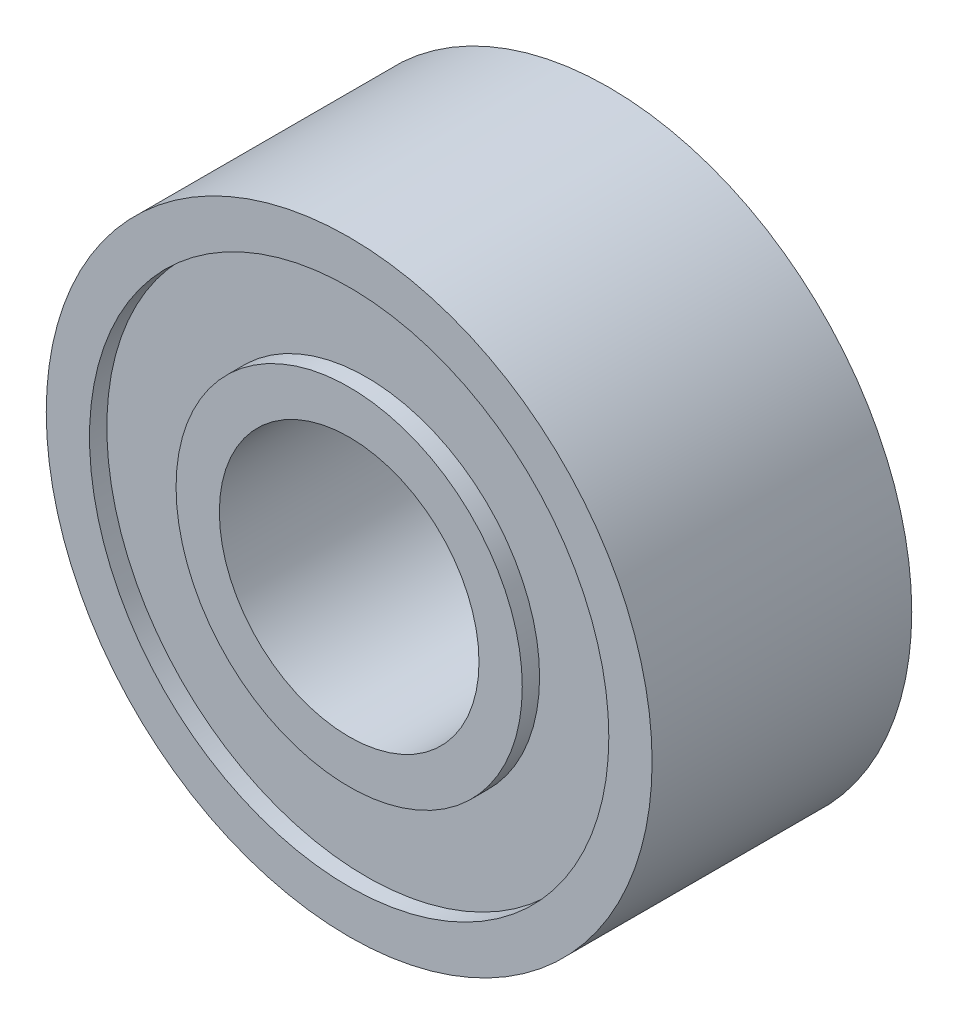
ISO-10303-21;
HEADER;
FILE_DESCRIPTION(('STEP AP214'),'2;1');
FILE_NAME('part.step','',(''),(''),'','','');
FILE_SCHEMA(('AUTOMOTIVE_DESIGN { 1 0 10303 214 1 1 1 1 }'));
ENDSEC;
DATA;
#1=APPLICATION_CONTEXT('core data for automotive mechanical design processes');
#2=APPLICATION_PROTOCOL_DEFINITION('international standard','automotive_design',2000,#1);
#3=PRODUCT_CONTEXT('',#1,'mechanical');
#4=PRODUCT('Part','Part','',(#3));
#5=PRODUCT_RELATED_PRODUCT_CATEGORY('part','',(#4));
#6=PRODUCT_DEFINITION_FORMATION('','',#4);
#7=PRODUCT_DEFINITION_CONTEXT('part definition',#1,'design');
#8=PRODUCT_DEFINITION('design','',#6,#7);
#9=PRODUCT_DEFINITION_SHAPE('','',#8);
#10=(LENGTH_UNIT() NAMED_UNIT(*) SI_UNIT(.MILLI.,.METRE.));
#11=(NAMED_UNIT(*) PLANE_ANGLE_UNIT() SI_UNIT($,.RADIAN.));
#12=(NAMED_UNIT(*) SI_UNIT($,.STERADIAN.) SOLID_ANGLE_UNIT());
#13=UNCERTAINTY_MEASURE_WITH_UNIT(LENGTH_MEASURE(1.E-05),#10,'distance_accuracy_value','');
#14=(GEOMETRIC_REPRESENTATION_CONTEXT(3) GLOBAL_UNCERTAINTY_ASSIGNED_CONTEXT((#13)) GLOBAL_UNIT_ASSIGNED_CONTEXT((#10,
#11,#12)) REPRESENTATION_CONTEXT('',''));
#15=CARTESIAN_POINT('',(0.,0.,0.));
#16=DIRECTION('',(0.,0.,1.));
#17=DIRECTION('',(1.,0.,0.));
#18=AXIS2_PLACEMENT_3D('',#15,#16,#17);
#19=CARTESIAN_POINT('',(0.,0.,0.2));
#20=DIRECTION('',(0.,0.,1.));
#21=DIRECTION('',(1.,0.,0.));
#22=AXIS2_PLACEMENT_3D('',#19,#20,#21);
#23=CYLINDRICAL_SURFACE('',#22,3.);
#24=CARTESIAN_POINT('',(0.,0.,0.2));
#25=DIRECTION('',(0.,0.,1.));
#26=DIRECTION('',(1.,0.,0.));
#27=AXIS2_PLACEMENT_3D('',#24,#25,#26);
#28=CIRCLE('',#27,3.);
#29=CARTESIAN_POINT('',(3.,0.,0.2));
#30=VERTEX_POINT('',#29);
#31=EDGE_CURVE('E11',#30,#30,#28,.T.);
#32=ORIENTED_EDGE('',*,*,#31,.T.);
#33=EDGE_LOOP('',(#32));
#34=FACE_BOUND('',#33,.T.);
#35=CARTESIAN_POINT('',(0.,0.,2.8));
#36=DIRECTION('',(0.,0.,1.));
#37=DIRECTION('',(1.,0.,0.));
#38=AXIS2_PLACEMENT_3D('',#35,#36,#37);
#39=CIRCLE('',#38,3.);
#40=CARTESIAN_POINT('',(3.,0.,2.8));
#41=VERTEX_POINT('',#40);
#42=EDGE_CURVE('E60',#41,#41,#39,.T.);
#43=ORIENTED_EDGE('',*,*,#42,.F.);
#44=EDGE_LOOP('',(#43));
#45=FACE_BOUND('',#44,.T.);
#46=ADVANCED_FACE('F47',(#34,#45),#23,.T.);
#47=CARTESIAN_POINT('',(0.,0.,0.2));
#48=DIRECTION('',(0.,0.,1.));
#49=DIRECTION('',(1.,0.,0.));
#50=AXIS2_PLACEMENT_3D('',#47,#48,#49);
#51=CYLINDRICAL_SURFACE('',#50,2.);
#52=CARTESIAN_POINT('',(0.,0.,0.2));
#53=DIRECTION('',(0.,0.,1.));
#54=DIRECTION('',(1.,0.,0.));
#55=AXIS2_PLACEMENT_3D('',#52,#53,#54);
#56=CIRCLE('',#55,2.);
#57=CARTESIAN_POINT('',(2.,0.,0.2));
#58=VERTEX_POINT('',#57);
#59=EDGE_CURVE('E54',#58,#58,#56,.T.);
#60=ORIENTED_EDGE('',*,*,#59,.F.);
#61=EDGE_LOOP('',(#60));
#62=FACE_BOUND('',#61,.T.);
#63=CARTESIAN_POINT('',(0.,0.,2.8));
#64=DIRECTION('',(0.,0.,1.));
#65=DIRECTION('',(1.,0.,0.));
#66=AXIS2_PLACEMENT_3D('',#63,#64,#65);
#67=CIRCLE('',#66,2.);
#68=CARTESIAN_POINT('',(2.,0.,2.8));
#69=VERTEX_POINT('',#68);
#70=EDGE_CURVE('E66',#69,#69,#67,.T.);
#71=ORIENTED_EDGE('',*,*,#70,.T.);
#72=EDGE_LOOP('',(#71));
#73=FACE_BOUND('',#72,.T.);
#74=ADVANCED_FACE('F74',(#62,#73),#51,.F.);
#75=CARTESIAN_POINT('',(0.,0.,0.2));
#76=DIRECTION('',(0.,0.,1.));
#77=DIRECTION('',(1.,0.,0.));
#78=AXIS2_PLACEMENT_3D('',#75,#76,#77);
#79=PLANE('',#78);
#80=ORIENTED_EDGE('',*,*,#59,.T.);
#81=EDGE_LOOP('',(#80));
#82=FACE_BOUND('',#81,.T.);
#83=ORIENTED_EDGE('',*,*,#31,.F.);
#84=EDGE_LOOP('',(#83));
#85=FACE_BOUND('',#84,.T.);
#86=ADVANCED_FACE('F79',(#82,#85),#79,.F.);
#87=CARTESIAN_POINT('',(0.,0.,2.8));
#88=DIRECTION('',(0.,0.,1.));
#89=DIRECTION('',(1.,0.,0.));
#90=AXIS2_PLACEMENT_3D('',#87,#88,#89);
#91=PLANE('',#90);
#92=ORIENTED_EDGE('',*,*,#70,.F.);
#93=EDGE_LOOP('',(#92));
#94=FACE_BOUND('',#93,.T.);
#95=ORIENTED_EDGE('',*,*,#42,.T.);
#96=EDGE_LOOP('',(#95));
#97=FACE_BOUND('',#96,.T.);
#98=ADVANCED_FACE('F76',(#94,#97),#91,.T.);
#99=CLOSED_SHELL('',(#46,#74,#86,#98));
#100=MANIFOLD_SOLID_BREP('B2',#99);
#101=CARTESIAN_POINT('',(0.,0.,3.));
#102=DIRECTION('',(0.,0.,1.));
#103=DIRECTION('',(1.,0.,0.));
#104=AXIS2_PLACEMENT_3D('',#101,#102,#103);
#105=PLANE('',#104);
#106=CARTESIAN_POINT('',(0.,0.,3.));
#107=DIRECTION('',(0.,0.,1.));
#108=DIRECTION('',(1.,0.,0.));
#109=AXIS2_PLACEMENT_3D('',#106,#107,#108);
#110=CIRCLE('',#109,3.);
#111=CARTESIAN_POINT('',(3.,0.,3.));
#112=VERTEX_POINT('',#111);
#113=EDGE_CURVE('E46',#112,#112,#110,.T.);
#114=ORIENTED_EDGE('',*,*,#113,.F.);
#115=EDGE_LOOP('',(#114));
#116=FACE_BOUND('',#115,.T.);
#117=CARTESIAN_POINT('',(0.,0.,3.));
#118=DIRECTION('',(0.,0.,1.));
#119=DIRECTION('',(1.,0.,0.));
#120=AXIS2_PLACEMENT_3D('',#117,#118,#119);
#121=CIRCLE('',#120,3.5);
#122=CARTESIAN_POINT('',(3.5,0.,3.));
#123=VERTEX_POINT('',#122);
#124=EDGE_CURVE('E148',#123,#123,#121,.T.);
#125=ORIENTED_EDGE('',*,*,#124,.T.);
#126=EDGE_LOOP('',(#125));
#127=FACE_BOUND('',#126,.T.);
#128=ADVANCED_FACE('F131',(#116,#127),#105,.T.);
#129=CARTESIAN_POINT('',(0.,0.,0.));
#130=DIRECTION('',(0.,0.,1.));
#131=DIRECTION('',(1.,0.,0.));
#132=AXIS2_PLACEMENT_3D('',#129,#130,#131);
#133=PLANE('',#132);
#134=CARTESIAN_POINT('',(0.,0.,0.));
#135=DIRECTION('',(0.,0.,1.));
#136=DIRECTION('',(1.,0.,0.));
#137=AXIS2_PLACEMENT_3D('',#134,#135,#136);
#138=CIRCLE('',#137,3.);
#139=CARTESIAN_POINT('',(3.,0.,0.));
#140=VERTEX_POINT('',#139);
#141=EDGE_CURVE('E135',#140,#140,#138,.T.);
#142=ORIENTED_EDGE('',*,*,#141,.T.);
#143=EDGE_LOOP('',(#142));
#144=FACE_BOUND('',#143,.T.);
#145=CARTESIAN_POINT('',(0.,0.,0.));
#146=DIRECTION('',(0.,0.,1.));
#147=DIRECTION('',(1.,0.,0.));
#148=AXIS2_PLACEMENT_3D('',#145,#146,#147);
#149=CIRCLE('',#148,3.5);
#150=CARTESIAN_POINT('',(3.5,0.,0.));
#151=VERTEX_POINT('',#150);
#152=EDGE_CURVE('E140',#151,#151,#149,.T.);
#153=ORIENTED_EDGE('',*,*,#152,.F.);
#154=EDGE_LOOP('',(#153));
#155=FACE_BOUND('',#154,.T.);
#156=ADVANCED_FACE('F133',(#144,#155),#133,.F.);
#157=CARTESIAN_POINT('',(0.,0.,3.));
#158=DIRECTION('',(0.,0.,-1.));
#159=DIRECTION('',(-1.,0.,0.));
#160=AXIS2_PLACEMENT_3D('',#157,#158,#159);
#161=CYLINDRICAL_SURFACE('',#160,3.5);
#162=ORIENTED_EDGE('',*,*,#124,.F.);
#163=EDGE_LOOP('',(#162));
#164=FACE_BOUND('',#163,.T.);
#165=ORIENTED_EDGE('',*,*,#152,.T.);
#166=EDGE_LOOP('',(#165));
#167=FACE_BOUND('',#166,.T.);
#168=ADVANCED_FACE('F163',(#164,#167),#161,.T.);
#169=CARTESIAN_POINT('',(0.,0.,0.));
#170=DIRECTION('',(0.,0.,1.));
#171=DIRECTION('',(1.,0.,0.));
#172=AXIS2_PLACEMENT_3D('',#169,#170,#171);
#173=CYLINDRICAL_SURFACE('',#172,3.);
#174=ORIENTED_EDGE('',*,*,#113,.T.);
#175=EDGE_LOOP('',(#174));
#176=FACE_BOUND('',#175,.T.);
#177=ORIENTED_EDGE('',*,*,#141,.F.);
#178=EDGE_LOOP('',(#177));
#179=FACE_BOUND('',#178,.T.);
#180=ADVANCED_FACE('F161',(#176,#179),#173,.F.);
#181=CLOSED_SHELL('',(#128,#156,#168,#180));
#182=MANIFOLD_SOLID_BREP('B6',#181);
#183=CARTESIAN_POINT('',(0.,0.,3.));
#184=DIRECTION('',(0.,0.,1.));
#185=DIRECTION('',(1.,0.,0.));
#186=AXIS2_PLACEMENT_3D('',#183,#184,#185);
#187=PLANE('',#186);
#188=CARTESIAN_POINT('',(0.,0.,3.));
#189=DIRECTION('',(0.,0.,1.));
#190=DIRECTION('',(1.,0.,0.));
#191=AXIS2_PLACEMENT_3D('',#188,#189,#190);
#192=CIRCLE('',#191,1.5);
#193=CARTESIAN_POINT('',(1.5,0.,3.));
#194=VERTEX_POINT('',#193);
#195=EDGE_CURVE('E130',#194,#194,#192,.T.);
#196=ORIENTED_EDGE('',*,*,#195,.F.);
#197=EDGE_LOOP('',(#196));
#198=FACE_BOUND('',#197,.T.);
#199=CARTESIAN_POINT('',(0.,0.,3.));
#200=DIRECTION('',(0.,0.,1.));
#201=DIRECTION('',(1.,0.,0.));
#202=AXIS2_PLACEMENT_3D('',#199,#200,#201);
#203=CIRCLE('',#202,2.);
#204=CARTESIAN_POINT('',(2.,0.,3.));
#205=VERTEX_POINT('',#204);
#206=EDGE_CURVE('E224',#205,#205,#203,.T.);
#207=ORIENTED_EDGE('',*,*,#206,.T.);
#208=EDGE_LOOP('',(#207));
#209=FACE_BOUND('',#208,.T.);
#210=ADVANCED_FACE('F208',(#198,#209),#187,.T.);
#211=CARTESIAN_POINT('',(0.,0.,3.));
#212=DIRECTION('',(0.,0.,-1.));
#213=DIRECTION('',(-1.,0.,0.));
#214=AXIS2_PLACEMENT_3D('',#211,#212,#213);
#215=CYLINDRICAL_SURFACE('',#214,1.5);
#216=ORIENTED_EDGE('',*,*,#195,.T.);
#217=EDGE_LOOP('',(#216));
#218=FACE_BOUND('',#217,.T.);
#219=CARTESIAN_POINT('',(0.,0.,0.));
#220=DIRECTION('',(0.,0.,1.));
#221=DIRECTION('',(1.,0.,0.));
#222=AXIS2_PLACEMENT_3D('',#219,#220,#221);
#223=CIRCLE('',#222,1.5);
#224=CARTESIAN_POINT('',(1.5,0.,0.));
#225=VERTEX_POINT('',#224);
#226=EDGE_CURVE('E212',#225,#225,#223,.T.);
#227=ORIENTED_EDGE('',*,*,#226,.F.);
#228=EDGE_LOOP('',(#227));
#229=FACE_BOUND('',#228,.T.);
#230=ADVANCED_FACE('F236',(#218,#229),#215,.F.);
#231=CARTESIAN_POINT('',(0.,0.,0.));
#232=DIRECTION('',(0.,0.,1.));
#233=DIRECTION('',(1.,0.,0.));
#234=AXIS2_PLACEMENT_3D('',#231,#232,#233);
#235=PLANE('',#234);
#236=ORIENTED_EDGE('',*,*,#226,.T.);
#237=EDGE_LOOP('',(#236));
#238=FACE_BOUND('',#237,.T.);
#239=CARTESIAN_POINT('',(0.,0.,0.));
#240=DIRECTION('',(0.,0.,1.));
#241=DIRECTION('',(1.,0.,0.));
#242=AXIS2_PLACEMENT_3D('',#239,#240,#241);
#243=CIRCLE('',#242,2.);
#244=CARTESIAN_POINT('',(2.,0.,0.));
#245=VERTEX_POINT('',#244);
#246=EDGE_CURVE('E222',#245,#245,#243,.T.);
#247=ORIENTED_EDGE('',*,*,#246,.F.);
#248=EDGE_LOOP('',(#247));
#249=FACE_BOUND('',#248,.T.);
#250=ADVANCED_FACE('F210',(#238,#249),#235,.F.);
#251=CARTESIAN_POINT('',(0.,0.,0.));
#252=DIRECTION('',(0.,0.,1.));
#253=DIRECTION('',(1.,0.,0.));
#254=AXIS2_PLACEMENT_3D('',#251,#252,#253);
#255=CYLINDRICAL_SURFACE('',#254,2.);
#256=ORIENTED_EDGE('',*,*,#206,.F.);
#257=EDGE_LOOP('',(#256));
#258=FACE_BOUND('',#257,.T.);
#259=ORIENTED_EDGE('',*,*,#246,.T.);
#260=EDGE_LOOP('',(#259));
#261=FACE_BOUND('',#260,.T.);
#262=ADVANCED_FACE('F233',(#258,#261),#255,.T.);
#263=CLOSED_SHELL('',(#210,#230,#250,#262));
#264=MANIFOLD_SOLID_BREP('B41',#263);
#265=ADVANCED_BREP_SHAPE_REPRESENTATION('',(#18,#100,#182,#264),#14);
#266=SHAPE_DEFINITION_REPRESENTATION(#9,#265);
ENDSEC;
END-ISO-10303-21;
